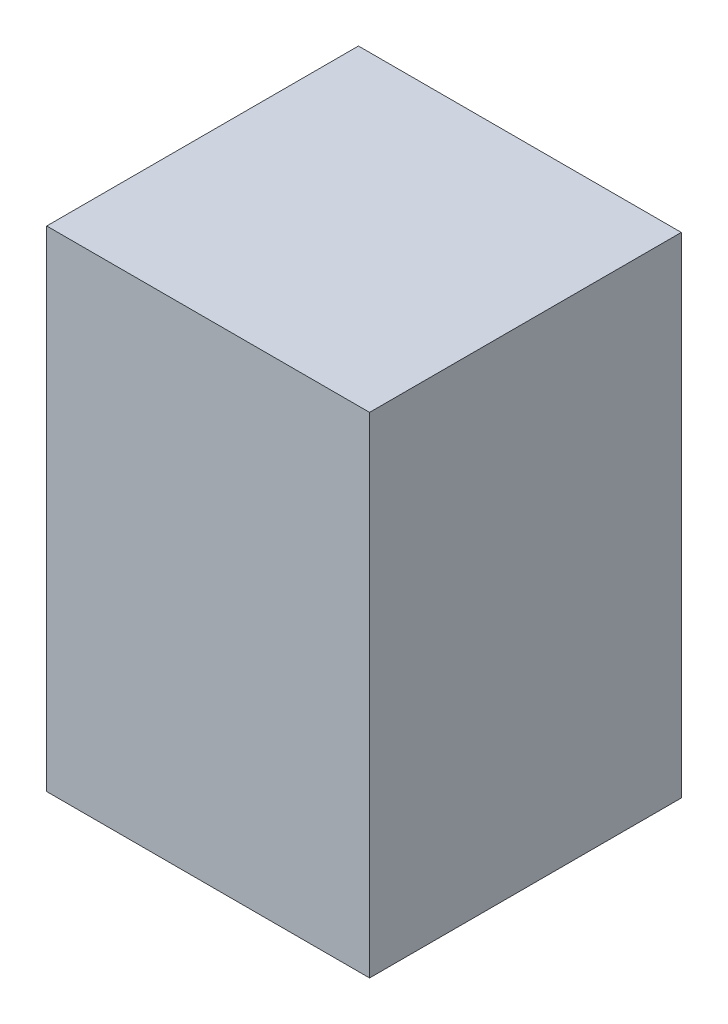
ISO-10303-21;
HEADER;
FILE_DESCRIPTION(('STEP AP214'),'2;1');
FILE_NAME('part.step','',(''),(''),'','','');
FILE_SCHEMA(('AUTOMOTIVE_DESIGN { 1 0 10303 214 1 1 1 1 }'));
ENDSEC;
DATA;
#1=APPLICATION_CONTEXT('core data for automotive mechanical design processes');
#2=APPLICATION_PROTOCOL_DEFINITION('international standard','automotive_design',2000,#1);
#3=PRODUCT_CONTEXT('',#1,'mechanical');
#4=PRODUCT('Part','Part','',(#3));
#5=PRODUCT_RELATED_PRODUCT_CATEGORY('part','',(#4));
#6=PRODUCT_DEFINITION_FORMATION('','',#4);
#7=PRODUCT_DEFINITION_CONTEXT('part definition',#1,'design');
#8=PRODUCT_DEFINITION('design','',#6,#7);
#9=PRODUCT_DEFINITION_SHAPE('','',#8);
#10=(LENGTH_UNIT() NAMED_UNIT(*) SI_UNIT(.MILLI.,.METRE.));
#11=(NAMED_UNIT(*) PLANE_ANGLE_UNIT() SI_UNIT($,.RADIAN.));
#12=(NAMED_UNIT(*) SI_UNIT($,.STERADIAN.) SOLID_ANGLE_UNIT());
#13=UNCERTAINTY_MEASURE_WITH_UNIT(LENGTH_MEASURE(1.E-05),#10,'distance_accuracy_value','');
#14=(GEOMETRIC_REPRESENTATION_CONTEXT(3) GLOBAL_UNCERTAINTY_ASSIGNED_CONTEXT((#13)) GLOBAL_UNIT_ASSIGNED_CONTEXT((#10,
#11,#12)) REPRESENTATION_CONTEXT('',''));
#15=CARTESIAN_POINT('',(0.,0.,0.));
#16=DIRECTION('',(0.,0.,1.));
#17=DIRECTION('',(1.,0.,0.));
#18=AXIS2_PLACEMENT_3D('',#15,#16,#17);
#19=CARTESIAN_POINT('',(-0.72499982,1.10000034,0.));
#20=DIRECTION('',(1.,0.,0.));
#21=DIRECTION('',(0.,-1.,0.));
#22=AXIS2_PLACEMENT_3D('',#19,#20,#21);
#23=PLANE('',#22);
#24=DIRECTION('',(0.,-1.,0.));
#25=VECTOR('',#24,1.);
#26=CARTESIAN_POINT('',(-0.72499982,1.10000034,0.));
#27=LINE('',#26,#25);
#28=CARTESIAN_POINT('',(-0.72499982,1.10000034,0.));
#29=VERTEX_POINT('',#28);
#30=CARTESIAN_POINT('',(-0.72499982,-1.10000034,0.));
#31=VERTEX_POINT('',#30);
#32=EDGE_CURVE('E11',#29,#31,#27,.T.);
#33=ORIENTED_EDGE('',*,*,#32,.T.);
#34=DIRECTION('',(0.,0.,1.));
#35=VECTOR('',#34,1.);
#36=CARTESIAN_POINT('',(-0.72499982,-1.10000034,0.));
#37=LINE('',#36,#35);
#38=CARTESIAN_POINT('',(-0.72499982,-1.10000034,1.39999974));
#39=VERTEX_POINT('',#38);
#40=EDGE_CURVE('E24',#31,#39,#37,.T.);
#41=ORIENTED_EDGE('',*,*,#40,.T.);
#42=DIRECTION('',(0.,-1.,0.));
#43=VECTOR('',#42,1.);
#44=CARTESIAN_POINT('',(-0.72499982,1.10000034,1.39999974));
#45=LINE('',#44,#43);
#46=CARTESIAN_POINT('',(-0.72499982,1.10000034,1.39999974));
#47=VERTEX_POINT('',#46);
#48=EDGE_CURVE('E87',#47,#39,#45,.T.);
#49=ORIENTED_EDGE('',*,*,#48,.F.);
#50=DIRECTION('',(0.,0.,1.));
#51=VECTOR('',#50,1.);
#52=CARTESIAN_POINT('',(-0.72499982,1.10000034,0.));
#53=LINE('',#52,#51);
#54=EDGE_CURVE('E36',#29,#47,#53,.T.);
#55=ORIENTED_EDGE('',*,*,#54,.F.);
#56=EDGE_LOOP('',(#33,#41,#49,#55));
#57=FACE_BOUND('',#56,.T.);
#58=ADVANCED_FACE('F17',(#57),#23,.F.);
#59=CARTESIAN_POINT('',(-0.72499982,-1.10000034,0.));
#60=DIRECTION('',(0.,1.,0.));
#61=DIRECTION('',(1.,0.,0.));
#62=AXIS2_PLACEMENT_3D('',#59,#60,#61);
#63=PLANE('',#62);
#64=DIRECTION('',(1.,0.,0.));
#65=VECTOR('',#64,1.);
#66=CARTESIAN_POINT('',(-0.72499982,-1.10000034,0.));
#67=LINE('',#66,#65);
#68=CARTESIAN_POINT('',(0.72499982,-1.10000034,0.));
#69=VERTEX_POINT('',#68);
#70=EDGE_CURVE('E84',#31,#69,#67,.T.);
#71=ORIENTED_EDGE('',*,*,#70,.T.);
#72=DIRECTION('',(0.,0.,1.));
#73=VECTOR('',#72,1.);
#74=CARTESIAN_POINT('',(0.72499982,-1.10000034,0.));
#75=LINE('',#74,#73);
#76=CARTESIAN_POINT('',(0.72499982,-1.10000034,1.39999974));
#77=VERTEX_POINT('',#76);
#78=EDGE_CURVE('E82',#69,#77,#75,.T.);
#79=ORIENTED_EDGE('',*,*,#78,.T.);
#80=DIRECTION('',(1.,0.,0.));
#81=VECTOR('',#80,1.);
#82=CARTESIAN_POINT('',(-0.72499982,-1.10000034,1.39999974));
#83=LINE('',#82,#81);
#84=EDGE_CURVE('E62',#39,#77,#83,.T.);
#85=ORIENTED_EDGE('',*,*,#84,.F.);
#86=ORIENTED_EDGE('',*,*,#40,.F.);
#87=EDGE_LOOP('',(#71,#79,#85,#86));
#88=FACE_BOUND('',#87,.T.);
#89=ADVANCED_FACE('F89',(#88),#63,.F.);
#90=CARTESIAN_POINT('',(0.72499982,-1.10000034,0.));
#91=DIRECTION('',(-1.,0.,0.));
#92=DIRECTION('',(0.,1.,0.));
#93=AXIS2_PLACEMENT_3D('',#90,#91,#92);
#94=PLANE('',#93);
#95=DIRECTION('',(0.,1.,0.));
#96=VECTOR('',#95,1.);
#97=CARTESIAN_POINT('',(0.72499982,-1.10000034,0.));
#98=LINE('',#97,#96);
#99=CARTESIAN_POINT('',(0.72499982,1.10000034,0.));
#100=VERTEX_POINT('',#99);
#101=EDGE_CURVE('E71',#69,#100,#98,.T.);
#102=ORIENTED_EDGE('',*,*,#101,.T.);
#103=DIRECTION('',(0.,0.,1.));
#104=VECTOR('',#103,1.);
#105=CARTESIAN_POINT('',(0.72499982,1.10000034,0.));
#106=LINE('',#105,#104);
#107=CARTESIAN_POINT('',(0.72499982,1.10000034,1.39999974));
#108=VERTEX_POINT('',#107);
#109=EDGE_CURVE('E65',#100,#108,#106,.T.);
#110=ORIENTED_EDGE('',*,*,#109,.T.);
#111=DIRECTION('',(0.,1.,0.));
#112=VECTOR('',#111,1.);
#113=CARTESIAN_POINT('',(0.72499982,-1.10000034,1.39999974));
#114=LINE('',#113,#112);
#115=EDGE_CURVE('E57',#77,#108,#114,.T.);
#116=ORIENTED_EDGE('',*,*,#115,.F.);
#117=ORIENTED_EDGE('',*,*,#78,.F.);
#118=EDGE_LOOP('',(#102,#110,#116,#117));
#119=FACE_BOUND('',#118,.T.);
#120=ADVANCED_FACE('F69',(#119),#94,.F.);
#121=CARTESIAN_POINT('',(0.72499982,1.10000034,0.));
#122=DIRECTION('',(0.,-1.,0.));
#123=DIRECTION('',(-1.,0.,0.));
#124=AXIS2_PLACEMENT_3D('',#121,#122,#123);
#125=PLANE('',#124);
#126=DIRECTION('',(-1.,0.,0.));
#127=VECTOR('',#126,1.);
#128=CARTESIAN_POINT('',(0.72499982,1.10000034,0.));
#129=LINE('',#128,#127);
#130=EDGE_CURVE('E66',#100,#29,#129,.T.);
#131=ORIENTED_EDGE('',*,*,#130,.T.);
#132=ORIENTED_EDGE('',*,*,#54,.T.);
#133=DIRECTION('',(-1.,0.,0.));
#134=VECTOR('',#133,1.);
#135=CARTESIAN_POINT('',(0.72499982,1.10000034,1.39999974));
#136=LINE('',#135,#134);
#137=EDGE_CURVE('E61',#108,#47,#136,.T.);
#138=ORIENTED_EDGE('',*,*,#137,.F.);
#139=ORIENTED_EDGE('',*,*,#109,.F.);
#140=EDGE_LOOP('',(#131,#132,#138,#139));
#141=FACE_BOUND('',#140,.T.);
#142=ADVANCED_FACE('F76',(#141),#125,.F.);
#143=CARTESIAN_POINT('',(-0.72499982,1.10000034,0.));
#144=DIRECTION('',(0.,0.,-1.));
#145=DIRECTION('',(-1.,0.,0.));
#146=AXIS2_PLACEMENT_3D('',#143,#144,#145);
#147=PLANE('',#146);
#148=ORIENTED_EDGE('',*,*,#130,.F.);
#149=ORIENTED_EDGE('',*,*,#101,.F.);
#150=ORIENTED_EDGE('',*,*,#70,.F.);
#151=ORIENTED_EDGE('',*,*,#32,.F.);
#152=EDGE_LOOP('',(#148,#149,#150,#151));
#153=FACE_BOUND('',#152,.T.);
#154=ADVANCED_FACE('F91',(#153),#147,.T.);
#155=CARTESIAN_POINT('',(-0.72499982,1.10000034,1.39999974));
#156=DIRECTION('',(0.,0.,-1.));
#157=DIRECTION('',(-1.,0.,0.));
#158=AXIS2_PLACEMENT_3D('',#155,#156,#157);
#159=PLANE('',#158);
#160=ORIENTED_EDGE('',*,*,#48,.T.);
#161=ORIENTED_EDGE('',*,*,#84,.T.);
#162=ORIENTED_EDGE('',*,*,#115,.T.);
#163=ORIENTED_EDGE('',*,*,#137,.T.);
#164=EDGE_LOOP('',(#160,#161,#162,#163));
#165=FACE_BOUND('',#164,.T.);
#166=ADVANCED_FACE('F59',(#165),#159,.F.);
#167=CLOSED_SHELL('',(#58,#89,#120,#142,#154,#166));
#168=MANIFOLD_SOLID_BREP('B1',#167);
#169=ADVANCED_BREP_SHAPE_REPRESENTATION('',(#18,#168),#14);
#170=SHAPE_DEFINITION_REPRESENTATION(#9,#169);
ENDSEC;
END-ISO-10303-21;
